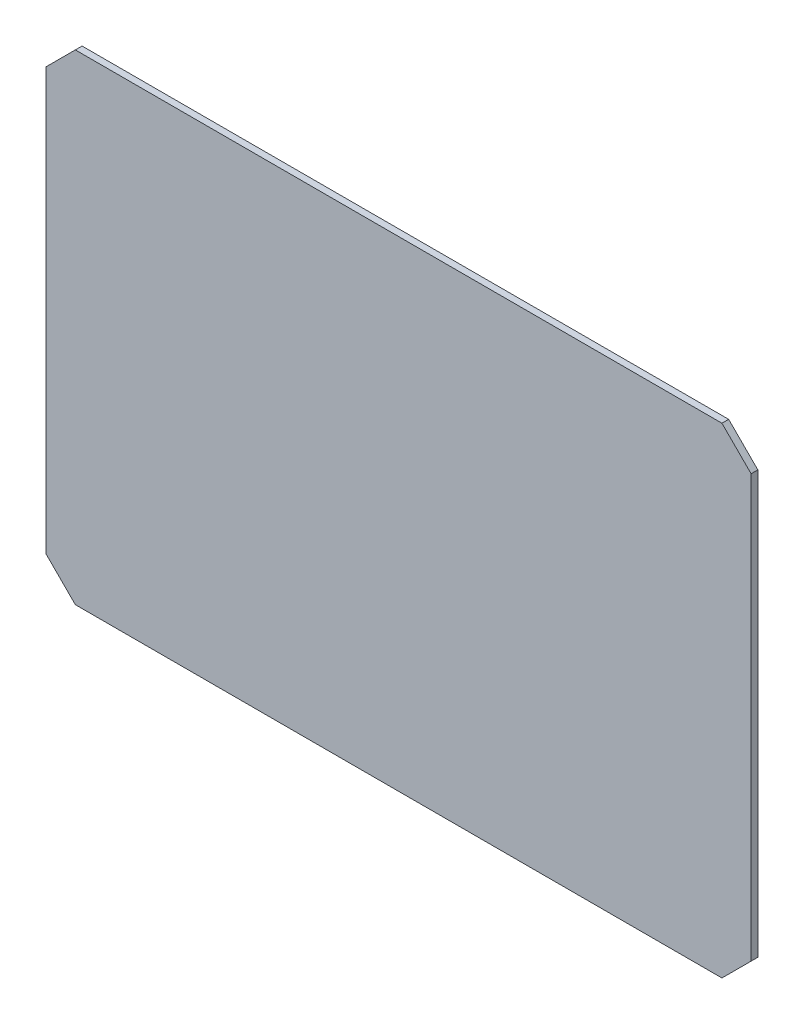
ISO-10303-21;
HEADER;
FILE_DESCRIPTION(('STEP AP214'),'2;1');
FILE_NAME('part.step','',(''),(''),'','','');
FILE_SCHEMA(('AUTOMOTIVE_DESIGN { 1 0 10303 214 1 1 1 1 }'));
ENDSEC;
DATA;
#1=APPLICATION_CONTEXT('core data for automotive mechanical design processes');
#2=APPLICATION_PROTOCOL_DEFINITION('international standard','automotive_design',2000,#1);
#3=PRODUCT_CONTEXT('',#1,'mechanical');
#4=PRODUCT('Part','Part','',(#3));
#5=PRODUCT_RELATED_PRODUCT_CATEGORY('part','',(#4));
#6=PRODUCT_DEFINITION_FORMATION('','',#4);
#7=PRODUCT_DEFINITION_CONTEXT('part definition',#1,'design');
#8=PRODUCT_DEFINITION('design','',#6,#7);
#9=PRODUCT_DEFINITION_SHAPE('','',#8);
#10=(LENGTH_UNIT() NAMED_UNIT(*) SI_UNIT(.MILLI.,.METRE.));
#11=(NAMED_UNIT(*) PLANE_ANGLE_UNIT() SI_UNIT($,.RADIAN.));
#12=(NAMED_UNIT(*) SI_UNIT($,.STERADIAN.) SOLID_ANGLE_UNIT());
#13=UNCERTAINTY_MEASURE_WITH_UNIT(LENGTH_MEASURE(1.E-05),#10,'distance_accuracy_value','');
#14=(GEOMETRIC_REPRESENTATION_CONTEXT(3) GLOBAL_UNCERTAINTY_ASSIGNED_CONTEXT((#13)) GLOBAL_UNIT_ASSIGNED_CONTEXT((#10,
#11,#12)) REPRESENTATION_CONTEXT('',''));
#15=CARTESIAN_POINT('',(0.,0.,0.));
#16=DIRECTION('',(0.,0.,1.));
#17=DIRECTION('',(1.,0.,0.));
#18=AXIS2_PLACEMENT_3D('',#15,#16,#17);
#19=CARTESIAN_POINT('',(157.,94.,3.));
#20=DIRECTION('',(-0.707106781186547,-0.707106781186548,0.));
#21=DIRECTION('',(0.707106781186548,-0.707106781186547,0.));
#22=AXIS2_PLACEMENT_3D('',#19,#20,#21);
#23=PLANE('',#22);
#24=DIRECTION('',(-0.707106781186548,0.707106781186547,0.));
#25=VECTOR('',#24,1.);
#26=CARTESIAN_POINT('',(157.,94.,0.));
#27=LINE('',#26,#25);
#28=CARTESIAN_POINT('',(157.,94.,0.));
#29=VERTEX_POINT('',#28);
#30=CARTESIAN_POINT('',(144.,107.,0.));
#31=VERTEX_POINT('',#30);
#32=EDGE_CURVE('E153',#29,#31,#27,.T.);
#33=ORIENTED_EDGE('',*,*,#32,.T.);
#34=DIRECTION('',(0.,0.,-1.));
#35=VECTOR('',#34,1.);
#36=CARTESIAN_POINT('',(144.,107.,3.));
#37=LINE('',#36,#35);
#38=CARTESIAN_POINT('',(144.,107.,3.));
#39=VERTEX_POINT('',#38);
#40=EDGE_CURVE('E12',#39,#31,#37,.T.);
#41=ORIENTED_EDGE('',*,*,#40,.F.);
#42=DIRECTION('',(-0.707106781186548,0.707106781186547,0.));
#43=VECTOR('',#42,1.);
#44=CARTESIAN_POINT('',(157.,94.,3.));
#45=LINE('',#44,#43);
#46=CARTESIAN_POINT('',(157.,94.,3.));
#47=VERTEX_POINT('',#46);
#48=EDGE_CURVE('E187',#47,#39,#45,.T.);
#49=ORIENTED_EDGE('',*,*,#48,.F.);
#50=DIRECTION('',(0.,0.,-1.));
#51=VECTOR('',#50,1.);
#52=CARTESIAN_POINT('',(157.,94.,3.));
#53=LINE('',#52,#51);
#54=EDGE_CURVE('E149',#47,#29,#53,.T.);
#55=ORIENTED_EDGE('',*,*,#54,.T.);
#56=EDGE_LOOP('',(#33,#41,#49,#55));
#57=FACE_BOUND('',#56,.T.);
#58=ADVANCED_FACE('F43',(#57),#23,.F.);
#59=CARTESIAN_POINT('',(144.,107.,3.));
#60=DIRECTION('',(0.,-1.,0.));
#61=DIRECTION('',(0.,0.,-1.));
#62=AXIS2_PLACEMENT_3D('',#59,#60,#61);
#63=PLANE('',#62);
#64=DIRECTION('',(-1.,0.,0.));
#65=VECTOR('',#64,1.);
#66=CARTESIAN_POINT('',(144.,107.,0.));
#67=LINE('',#66,#65);
#68=CARTESIAN_POINT('',(-144.,107.,0.));
#69=VERTEX_POINT('',#68);
#70=EDGE_CURVE('E158',#31,#69,#67,.T.);
#71=ORIENTED_EDGE('',*,*,#70,.T.);
#72=DIRECTION('',(0.,0.,-1.));
#73=VECTOR('',#72,1.);
#74=CARTESIAN_POINT('',(-144.,107.,3.));
#75=LINE('',#74,#73);
#76=CARTESIAN_POINT('',(-144.,107.,3.));
#77=VERTEX_POINT('',#76);
#78=EDGE_CURVE('E52',#77,#69,#75,.T.);
#79=ORIENTED_EDGE('',*,*,#78,.F.);
#80=DIRECTION('',(-1.,0.,0.));
#81=VECTOR('',#80,1.);
#82=CARTESIAN_POINT('',(144.,107.,3.));
#83=LINE('',#82,#81);
#84=EDGE_CURVE('E112',#39,#77,#83,.T.);
#85=ORIENTED_EDGE('',*,*,#84,.F.);
#86=ORIENTED_EDGE('',*,*,#40,.T.);
#87=EDGE_LOOP('',(#71,#79,#85,#86));
#88=FACE_BOUND('',#87,.T.);
#89=ADVANCED_FACE('F233',(#88),#63,.F.);
#90=CARTESIAN_POINT('',(-157.,94.,3.));
#91=DIRECTION('',(0.707106781186547,-0.707106781186548,0.));
#92=DIRECTION('',(0.707106781186548,0.707106781186547,0.));
#93=AXIS2_PLACEMENT_3D('',#90,#91,#92);
#94=PLANE('',#93);
#95=DIRECTION('',(-0.707106781186548,-0.707106781186547,0.));
#96=VECTOR('',#95,1.);
#97=CARTESIAN_POINT('',(-157.,94.,0.));
#98=LINE('',#97,#96);
#99=CARTESIAN_POINT('',(-157.,94.,0.));
#100=VERTEX_POINT('',#99);
#101=EDGE_CURVE('E169',#69,#100,#98,.T.);
#102=ORIENTED_EDGE('',*,*,#101,.T.);
#103=DIRECTION('',(0.,0.,-1.));
#104=VECTOR('',#103,1.);
#105=CARTESIAN_POINT('',(-157.,94.,3.));
#106=LINE('',#105,#104);
#107=CARTESIAN_POINT('',(-157.,94.,3.));
#108=VERTEX_POINT('',#107);
#109=EDGE_CURVE('E198',#108,#100,#106,.T.);
#110=ORIENTED_EDGE('',*,*,#109,.F.);
#111=DIRECTION('',(-0.707106781186548,-0.707106781186547,0.));
#112=VECTOR('',#111,1.);
#113=CARTESIAN_POINT('',(-157.,94.,3.));
#114=LINE('',#113,#112);
#115=EDGE_CURVE('E208',#77,#108,#114,.T.);
#116=ORIENTED_EDGE('',*,*,#115,.F.);
#117=ORIENTED_EDGE('',*,*,#78,.T.);
#118=EDGE_LOOP('',(#102,#110,#116,#117));
#119=FACE_BOUND('',#118,.T.);
#120=ADVANCED_FACE('F206',(#119),#94,.F.);
#121=CARTESIAN_POINT('',(-157.,-94.,3.));
#122=DIRECTION('',(1.,0.,0.));
#123=DIRECTION('',(0.,0.,-1.));
#124=AXIS2_PLACEMENT_3D('',#121,#122,#123);
#125=PLANE('',#124);
#126=DIRECTION('',(0.,-1.,0.));
#127=VECTOR('',#126,1.);
#128=CARTESIAN_POINT('',(-157.,-94.,0.));
#129=LINE('',#128,#127);
#130=CARTESIAN_POINT('',(-157.,-94.,0.));
#131=VERTEX_POINT('',#130);
#132=EDGE_CURVE('E172',#100,#131,#129,.T.);
#133=ORIENTED_EDGE('',*,*,#132,.T.);
#134=DIRECTION('',(0.,0.,-1.));
#135=VECTOR('',#134,1.);
#136=CARTESIAN_POINT('',(-157.,-94.,3.));
#137=LINE('',#136,#135);
#138=CARTESIAN_POINT('',(-157.,-94.,3.));
#139=VERTEX_POINT('',#138);
#140=EDGE_CURVE('E194',#139,#131,#137,.T.);
#141=ORIENTED_EDGE('',*,*,#140,.F.);
#142=DIRECTION('',(0.,-1.,0.));
#143=VECTOR('',#142,1.);
#144=CARTESIAN_POINT('',(-157.,-94.,3.));
#145=LINE('',#144,#143);
#146=EDGE_CURVE('E221',#108,#139,#145,.T.);
#147=ORIENTED_EDGE('',*,*,#146,.F.);
#148=ORIENTED_EDGE('',*,*,#109,.T.);
#149=EDGE_LOOP('',(#133,#141,#147,#148));
#150=FACE_BOUND('',#149,.T.);
#151=ADVANCED_FACE('F216',(#150),#125,.F.);
#152=CARTESIAN_POINT('',(-157.,-94.,3.));
#153=DIRECTION('',(0.707106781186547,0.707106781186548,0.));
#154=DIRECTION('',(-0.707106781186548,0.707106781186547,0.));
#155=AXIS2_PLACEMENT_3D('',#152,#153,#154);
#156=PLANE('',#155);
#157=DIRECTION('',(0.707106781186548,-0.707106781186547,0.));
#158=VECTOR('',#157,1.);
#159=CARTESIAN_POINT('',(-157.,-94.,0.));
#160=LINE('',#159,#158);
#161=CARTESIAN_POINT('',(-144.,-107.,0.));
#162=VERTEX_POINT('',#161);
#163=EDGE_CURVE('E176',#131,#162,#160,.T.);
#164=ORIENTED_EDGE('',*,*,#163,.T.);
#165=DIRECTION('',(0.,0.,-1.));
#166=VECTOR('',#165,1.);
#167=CARTESIAN_POINT('',(-144.,-107.,3.));
#168=LINE('',#167,#166);
#169=CARTESIAN_POINT('',(-144.,-107.,3.));
#170=VERTEX_POINT('',#169);
#171=EDGE_CURVE('E142',#170,#162,#168,.T.);
#172=ORIENTED_EDGE('',*,*,#171,.F.);
#173=DIRECTION('',(0.707106781186548,-0.707106781186547,0.));
#174=VECTOR('',#173,1.);
#175=CARTESIAN_POINT('',(-157.,-94.,3.));
#176=LINE('',#175,#174);
#177=EDGE_CURVE('E131',#139,#170,#176,.T.);
#178=ORIENTED_EDGE('',*,*,#177,.F.);
#179=ORIENTED_EDGE('',*,*,#140,.T.);
#180=EDGE_LOOP('',(#164,#172,#178,#179));
#181=FACE_BOUND('',#180,.T.);
#182=ADVANCED_FACE('F219',(#181),#156,.F.);
#183=CARTESIAN_POINT('',(144.,-107.,3.));
#184=DIRECTION('',(0.,1.,0.));
#185=DIRECTION('',(0.,0.,1.));
#186=AXIS2_PLACEMENT_3D('',#183,#184,#185);
#187=PLANE('',#186);
#188=DIRECTION('',(1.,0.,0.));
#189=VECTOR('',#188,1.);
#190=CARTESIAN_POINT('',(144.,-107.,0.));
#191=LINE('',#190,#189);
#192=CARTESIAN_POINT('',(144.,-107.,0.));
#193=VERTEX_POINT('',#192);
#194=EDGE_CURVE('E140',#162,#193,#191,.T.);
#195=ORIENTED_EDGE('',*,*,#194,.T.);
#196=DIRECTION('',(0.,0.,-1.));
#197=VECTOR('',#196,1.);
#198=CARTESIAN_POINT('',(144.,-107.,3.));
#199=LINE('',#198,#197);
#200=CARTESIAN_POINT('',(144.,-107.,3.));
#201=VERTEX_POINT('',#200);
#202=EDGE_CURVE('E137',#201,#193,#199,.T.);
#203=ORIENTED_EDGE('',*,*,#202,.F.);
#204=DIRECTION('',(1.,0.,0.));
#205=VECTOR('',#204,1.);
#206=CARTESIAN_POINT('',(144.,-107.,3.));
#207=LINE('',#206,#205);
#208=EDGE_CURVE('E125',#170,#201,#207,.T.);
#209=ORIENTED_EDGE('',*,*,#208,.F.);
#210=ORIENTED_EDGE('',*,*,#171,.T.);
#211=EDGE_LOOP('',(#195,#203,#209,#210));
#212=FACE_BOUND('',#211,.T.);
#213=ADVANCED_FACE('F138',(#212),#187,.F.);
#214=CARTESIAN_POINT('',(157.,-94.,3.));
#215=DIRECTION('',(-0.707106781186547,0.707106781186548,0.));
#216=DIRECTION('',(-0.707106781186548,-0.707106781186547,0.));
#217=AXIS2_PLACEMENT_3D('',#214,#215,#216);
#218=PLANE('',#217);
#219=DIRECTION('',(0.707106781186548,0.707106781186547,0.));
#220=VECTOR('',#219,1.);
#221=CARTESIAN_POINT('',(157.,-94.,0.));
#222=LINE('',#221,#220);
#223=CARTESIAN_POINT('',(157.,-94.,0.));
#224=VERTEX_POINT('',#223);
#225=EDGE_CURVE('E97',#193,#224,#222,.T.);
#226=ORIENTED_EDGE('',*,*,#225,.T.);
#227=DIRECTION('',(0.,0.,-1.));
#228=VECTOR('',#227,1.);
#229=CARTESIAN_POINT('',(157.,-94.,3.));
#230=LINE('',#229,#228);
#231=CARTESIAN_POINT('',(157.,-94.,3.));
#232=VERTEX_POINT('',#231);
#233=EDGE_CURVE('E143',#232,#224,#230,.T.);
#234=ORIENTED_EDGE('',*,*,#233,.F.);
#235=DIRECTION('',(0.707106781186548,0.707106781186547,0.));
#236=VECTOR('',#235,1.);
#237=CARTESIAN_POINT('',(157.,-94.,3.));
#238=LINE('',#237,#236);
#239=EDGE_CURVE('E129',#201,#232,#238,.T.);
#240=ORIENTED_EDGE('',*,*,#239,.F.);
#241=ORIENTED_EDGE('',*,*,#202,.T.);
#242=EDGE_LOOP('',(#226,#234,#240,#241));
#243=FACE_BOUND('',#242,.T.);
#244=ADVANCED_FACE('F145',(#243),#218,.F.);
#245=CARTESIAN_POINT('',(157.,-94.,3.));
#246=DIRECTION('',(-1.,0.,0.));
#247=DIRECTION('',(0.,0.,1.));
#248=AXIS2_PLACEMENT_3D('',#245,#246,#247);
#249=PLANE('',#248);
#250=DIRECTION('',(0.,1.,0.));
#251=VECTOR('',#250,1.);
#252=CARTESIAN_POINT('',(157.,-94.,0.));
#253=LINE('',#252,#251);
#254=EDGE_CURVE('E104',#224,#29,#253,.T.);
#255=ORIENTED_EDGE('',*,*,#254,.T.);
#256=ORIENTED_EDGE('',*,*,#54,.F.);
#257=DIRECTION('',(0.,1.,0.));
#258=VECTOR('',#257,1.);
#259=CARTESIAN_POINT('',(157.,-94.,3.));
#260=LINE('',#259,#258);
#261=EDGE_CURVE('E60',#232,#47,#260,.T.);
#262=ORIENTED_EDGE('',*,*,#261,.F.);
#263=ORIENTED_EDGE('',*,*,#233,.T.);
#264=EDGE_LOOP('',(#255,#256,#262,#263));
#265=FACE_BOUND('',#264,.T.);
#266=ADVANCED_FACE('F250',(#265),#249,.F.);
#267=CARTESIAN_POINT('',(0.,0.,3.));
#268=DIRECTION('',(0.,0.,-1.));
#269=DIRECTION('',(-1.,0.,0.));
#270=AXIS2_PLACEMENT_3D('',#267,#268,#269);
#271=PLANE('',#270);
#272=ORIENTED_EDGE('',*,*,#48,.T.);
#273=ORIENTED_EDGE('',*,*,#84,.T.);
#274=ORIENTED_EDGE('',*,*,#115,.T.);
#275=ORIENTED_EDGE('',*,*,#146,.T.);
#276=ORIENTED_EDGE('',*,*,#177,.T.);
#277=ORIENTED_EDGE('',*,*,#208,.T.);
#278=ORIENTED_EDGE('',*,*,#239,.T.);
#279=ORIENTED_EDGE('',*,*,#261,.T.);
#280=EDGE_LOOP('',(#272,#273,#274,#275,#276,#277,#278,#279));
#281=FACE_BOUND('',#280,.T.);
#282=ADVANCED_FACE('F127',(#281),#271,.F.);
#283=CARTESIAN_POINT('',(0.,0.,0.));
#284=DIRECTION('',(0.,0.,-1.));
#285=DIRECTION('',(-1.,0.,0.));
#286=AXIS2_PLACEMENT_3D('',#283,#284,#285);
#287=PLANE('',#286);
#288=ORIENTED_EDGE('',*,*,#32,.F.);
#289=ORIENTED_EDGE('',*,*,#254,.F.);
#290=ORIENTED_EDGE('',*,*,#225,.F.);
#291=ORIENTED_EDGE('',*,*,#194,.F.);
#292=ORIENTED_EDGE('',*,*,#163,.F.);
#293=ORIENTED_EDGE('',*,*,#132,.F.);
#294=ORIENTED_EDGE('',*,*,#101,.F.);
#295=ORIENTED_EDGE('',*,*,#70,.F.);
#296=EDGE_LOOP('',(#288,#289,#290,#291,#292,#293,#294,#295));
#297=FACE_BOUND('',#296,.T.);
#298=ADVANCED_FACE('F212',(#297),#287,.T.);
#299=CLOSED_SHELL('',(#58,#89,#120,#151,#182,#213,#244,#266,#282,#298));
#300=MANIFOLD_SOLID_BREP('B2',#299);
#301=ADVANCED_BREP_SHAPE_REPRESENTATION('',(#18,#300),#14);
#302=SHAPE_DEFINITION_REPRESENTATION(#9,#301);
ENDSEC;
END-ISO-10303-21;
